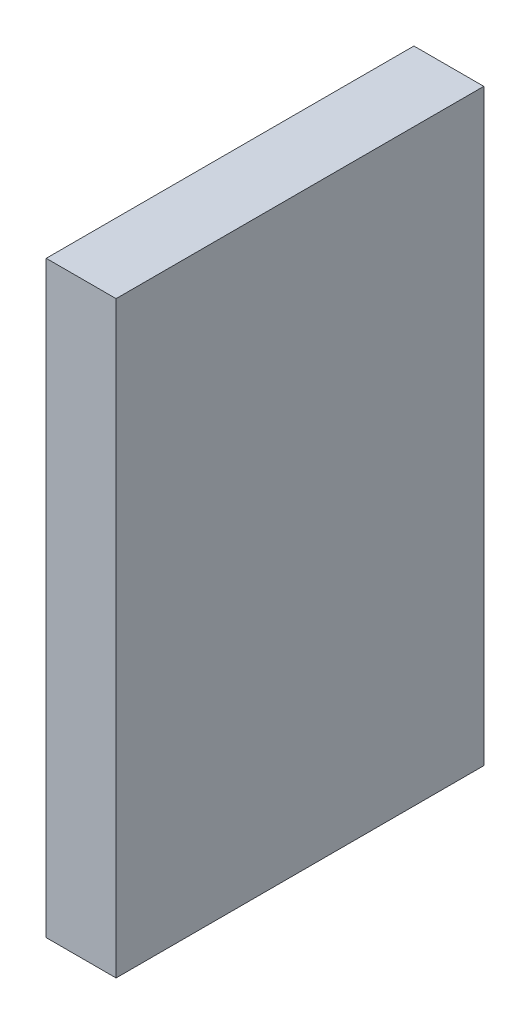
ISO-10303-21;
HEADER;
FILE_DESCRIPTION(('STEP AP214'),'2;1');
FILE_NAME('part.step','',(''),(''),'','','');
FILE_SCHEMA(('AUTOMOTIVE_DESIGN { 1 0 10303 214 1 1 1 1 }'));
ENDSEC;
DATA;
#1=APPLICATION_CONTEXT('core data for automotive mechanical design processes');
#2=APPLICATION_PROTOCOL_DEFINITION('international standard','automotive_design',2000,#1);
#3=PRODUCT_CONTEXT('',#1,'mechanical');
#4=PRODUCT('Part','Part','',(#3));
#5=PRODUCT_RELATED_PRODUCT_CATEGORY('part','',(#4));
#6=PRODUCT_DEFINITION_FORMATION('','',#4);
#7=PRODUCT_DEFINITION_CONTEXT('part definition',#1,'design');
#8=PRODUCT_DEFINITION('design','',#6,#7);
#9=PRODUCT_DEFINITION_SHAPE('','',#8);
#10=(LENGTH_UNIT() NAMED_UNIT(*) SI_UNIT(.MILLI.,.METRE.));
#11=(NAMED_UNIT(*) PLANE_ANGLE_UNIT() SI_UNIT($,.RADIAN.));
#12=(NAMED_UNIT(*) SI_UNIT($,.STERADIAN.) SOLID_ANGLE_UNIT());
#13=UNCERTAINTY_MEASURE_WITH_UNIT(LENGTH_MEASURE(1.E-05),#10,'distance_accuracy_value','');
#14=(GEOMETRIC_REPRESENTATION_CONTEXT(3) GLOBAL_UNCERTAINTY_ASSIGNED_CONTEXT((#13)) GLOBAL_UNIT_ASSIGNED_CONTEXT((#10,
#11,#12)) REPRESENTATION_CONTEXT('',''));
#15=CARTESIAN_POINT('',(0.,0.,0.));
#16=DIRECTION('',(0.,0.,1.));
#17=DIRECTION('',(1.,0.,0.));
#18=AXIS2_PLACEMENT_3D('',#15,#16,#17);
#19=CARTESIAN_POINT('',(9.5,-40.,-25.));
#20=DIRECTION('',(0.,0.,1.));
#21=DIRECTION('',(1.,0.,0.));
#22=AXIS2_PLACEMENT_3D('',#19,#20,#21);
#23=PLANE('',#22);
#24=DIRECTION('',(0.,1.,0.));
#25=VECTOR('',#24,1.);
#26=CARTESIAN_POINT('',(0.,-40.,-25.));
#27=LINE('',#26,#25);
#28=CARTESIAN_POINT('',(0.,-40.,-25.));
#29=VERTEX_POINT('',#28);
#30=CARTESIAN_POINT('',(0.,40.,-25.));
#31=VERTEX_POINT('',#30);
#32=EDGE_CURVE('E96',#29,#31,#27,.T.);
#33=ORIENTED_EDGE('',*,*,#32,.T.);
#34=DIRECTION('',(-1.,0.,0.));
#35=VECTOR('',#34,1.);
#36=CARTESIAN_POINT('',(9.5,40.,-25.));
#37=LINE('',#36,#35);
#38=CARTESIAN_POINT('',(9.5,40.,-25.));
#39=VERTEX_POINT('',#38);
#40=EDGE_CURVE('E11',#39,#31,#37,.T.);
#41=ORIENTED_EDGE('',*,*,#40,.F.);
#42=DIRECTION('',(0.,1.,0.));
#43=VECTOR('',#42,1.);
#44=CARTESIAN_POINT('',(9.5,-40.,-25.));
#45=LINE('',#44,#43);
#46=CARTESIAN_POINT('',(9.5,-40.,-25.));
#47=VERTEX_POINT('',#46);
#48=EDGE_CURVE('E84',#47,#39,#45,.T.);
#49=ORIENTED_EDGE('',*,*,#48,.F.);
#50=DIRECTION('',(-1.,0.,0.));
#51=VECTOR('',#50,1.);
#52=CARTESIAN_POINT('',(9.5,-40.,-25.));
#53=LINE('',#52,#51);
#54=EDGE_CURVE('E92',#47,#29,#53,.T.);
#55=ORIENTED_EDGE('',*,*,#54,.T.);
#56=EDGE_LOOP('',(#33,#41,#49,#55));
#57=FACE_BOUND('',#56,.T.);
#58=ADVANCED_FACE('F33',(#57),#23,.F.);
#59=CARTESIAN_POINT('',(9.5,40.,25.));
#60=DIRECTION('',(0.,-1.,0.));
#61=DIRECTION('',(0.,0.,-1.));
#62=AXIS2_PLACEMENT_3D('',#59,#60,#61);
#63=PLANE('',#62);
#64=DIRECTION('',(0.,0.,1.));
#65=VECTOR('',#64,1.);
#66=CARTESIAN_POINT('',(0.,40.,25.));
#67=LINE('',#66,#65);
#68=CARTESIAN_POINT('',(0.,40.,25.));
#69=VERTEX_POINT('',#68);
#70=EDGE_CURVE('E88',#31,#69,#67,.T.);
#71=ORIENTED_EDGE('',*,*,#70,.T.);
#72=DIRECTION('',(-1.,0.,0.));
#73=VECTOR('',#72,1.);
#74=CARTESIAN_POINT('',(9.5,40.,25.));
#75=LINE('',#74,#73);
#76=CARTESIAN_POINT('',(9.5,40.,25.));
#77=VERTEX_POINT('',#76);
#78=EDGE_CURVE('E41',#77,#69,#75,.T.);
#79=ORIENTED_EDGE('',*,*,#78,.F.);
#80=DIRECTION('',(0.,0.,1.));
#81=VECTOR('',#80,1.);
#82=CARTESIAN_POINT('',(9.5,40.,25.));
#83=LINE('',#82,#81);
#84=EDGE_CURVE('E79',#39,#77,#83,.T.);
#85=ORIENTED_EDGE('',*,*,#84,.F.);
#86=ORIENTED_EDGE('',*,*,#40,.T.);
#87=EDGE_LOOP('',(#71,#79,#85,#86));
#88=FACE_BOUND('',#87,.T.);
#89=ADVANCED_FACE('F87',(#88),#63,.F.);
#90=CARTESIAN_POINT('',(9.5,-40.,25.));
#91=DIRECTION('',(0.,0.,-1.));
#92=DIRECTION('',(-1.,0.,0.));
#93=AXIS2_PLACEMENT_3D('',#90,#91,#92);
#94=PLANE('',#93);
#95=DIRECTION('',(0.,-1.,0.));
#96=VECTOR('',#95,1.);
#97=CARTESIAN_POINT('',(0.,-40.,25.));
#98=LINE('',#97,#96);
#99=CARTESIAN_POINT('',(0.,-40.,25.));
#100=VERTEX_POINT('',#99);
#101=EDGE_CURVE('E66',#69,#100,#98,.T.);
#102=ORIENTED_EDGE('',*,*,#101,.T.);
#103=DIRECTION('',(-1.,0.,0.));
#104=VECTOR('',#103,1.);
#105=CARTESIAN_POINT('',(9.5,-40.,25.));
#106=LINE('',#105,#104);
#107=CARTESIAN_POINT('',(9.5,-40.,25.));
#108=VERTEX_POINT('',#107);
#109=EDGE_CURVE('E89',#108,#100,#106,.T.);
#110=ORIENTED_EDGE('',*,*,#109,.F.);
#111=DIRECTION('',(0.,-1.,0.));
#112=VECTOR('',#111,1.);
#113=CARTESIAN_POINT('',(9.5,-40.,25.));
#114=LINE('',#113,#112);
#115=EDGE_CURVE('E82',#77,#108,#114,.T.);
#116=ORIENTED_EDGE('',*,*,#115,.F.);
#117=ORIENTED_EDGE('',*,*,#78,.T.);
#118=EDGE_LOOP('',(#102,#110,#116,#117));
#119=FACE_BOUND('',#118,.T.);
#120=ADVANCED_FACE('F90',(#119),#94,.F.);
#121=CARTESIAN_POINT('',(9.5,-40.,25.));
#122=DIRECTION('',(0.,1.,0.));
#123=DIRECTION('',(0.,0.,1.));
#124=AXIS2_PLACEMENT_3D('',#121,#122,#123);
#125=PLANE('',#124);
#126=DIRECTION('',(0.,0.,-1.));
#127=VECTOR('',#126,1.);
#128=CARTESIAN_POINT('',(0.,-40.,25.));
#129=LINE('',#128,#127);
#130=EDGE_CURVE('E72',#100,#29,#129,.T.);
#131=ORIENTED_EDGE('',*,*,#130,.T.);
#132=ORIENTED_EDGE('',*,*,#54,.F.);
#133=DIRECTION('',(0.,0.,-1.));
#134=VECTOR('',#133,1.);
#135=CARTESIAN_POINT('',(9.5,-40.,25.));
#136=LINE('',#135,#134);
#137=EDGE_CURVE('E49',#108,#47,#136,.T.);
#138=ORIENTED_EDGE('',*,*,#137,.F.);
#139=ORIENTED_EDGE('',*,*,#109,.T.);
#140=EDGE_LOOP('',(#131,#132,#138,#139));
#141=FACE_BOUND('',#140,.T.);
#142=ADVANCED_FACE('F103',(#141),#125,.F.);
#143=CARTESIAN_POINT('',(9.5,0.,0.));
#144=DIRECTION('',(-1.,0.,0.));
#145=DIRECTION('',(0.,0.,1.));
#146=AXIS2_PLACEMENT_3D('',#143,#144,#145);
#147=PLANE('',#146);
#148=ORIENTED_EDGE('',*,*,#48,.T.);
#149=ORIENTED_EDGE('',*,*,#84,.T.);
#150=ORIENTED_EDGE('',*,*,#115,.T.);
#151=ORIENTED_EDGE('',*,*,#137,.T.);
#152=EDGE_LOOP('',(#148,#149,#150,#151));
#153=FACE_BOUND('',#152,.T.);
#154=ADVANCED_FACE('F80',(#153),#147,.F.);
#155=CARTESIAN_POINT('',(0.,0.,0.));
#156=DIRECTION('',(-1.,0.,0.));
#157=DIRECTION('',(0.,0.,1.));
#158=AXIS2_PLACEMENT_3D('',#155,#156,#157);
#159=PLANE('',#158);
#160=ORIENTED_EDGE('',*,*,#32,.F.);
#161=ORIENTED_EDGE('',*,*,#130,.F.);
#162=ORIENTED_EDGE('',*,*,#101,.F.);
#163=ORIENTED_EDGE('',*,*,#70,.F.);
#164=EDGE_LOOP('',(#160,#161,#162,#163));
#165=FACE_BOUND('',#164,.T.);
#166=ADVANCED_FACE('F106',(#165),#159,.T.);
#167=CLOSED_SHELL('',(#58,#89,#120,#142,#154,#166));
#168=MANIFOLD_SOLID_BREP('B2',#167);
#169=ADVANCED_BREP_SHAPE_REPRESENTATION('',(#18,#168),#14);
#170=SHAPE_DEFINITION_REPRESENTATION(#9,#169);
ENDSEC;
END-ISO-10303-21;
